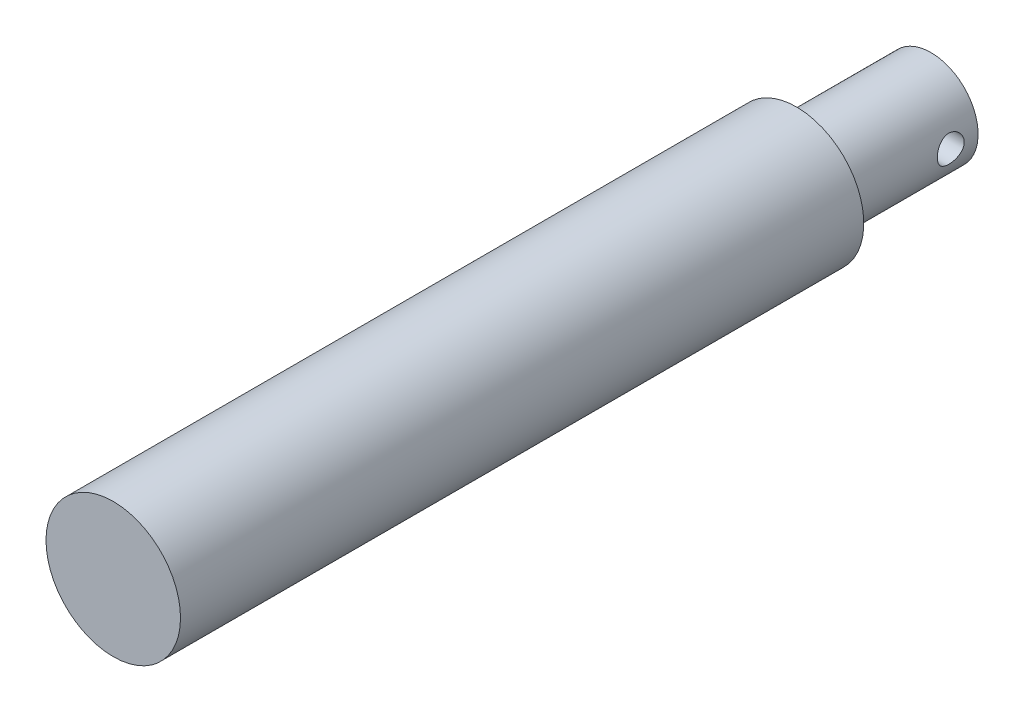
ISO-10303-21;
HEADER;
FILE_DESCRIPTION(('STEP AP214'),'2;1');
FILE_NAME('part.step','',(''),(''),'','','');
FILE_SCHEMA(('AUTOMOTIVE_DESIGN { 1 0 10303 214 1 1 1 1 }'));
ENDSEC;
DATA;
#1=APPLICATION_CONTEXT('core data for automotive mechanical design processes');
#2=APPLICATION_PROTOCOL_DEFINITION('international standard','automotive_design',2000,#1);
#3=PRODUCT_CONTEXT('',#1,'mechanical');
#4=PRODUCT('Part','Part','',(#3));
#5=PRODUCT_RELATED_PRODUCT_CATEGORY('part','',(#4));
#6=PRODUCT_DEFINITION_FORMATION('','',#4);
#7=PRODUCT_DEFINITION_CONTEXT('part definition',#1,'design');
#8=PRODUCT_DEFINITION('design','',#6,#7);
#9=PRODUCT_DEFINITION_SHAPE('','',#8);
#10=(LENGTH_UNIT() NAMED_UNIT(*) SI_UNIT(.MILLI.,.METRE.));
#11=(NAMED_UNIT(*) PLANE_ANGLE_UNIT() SI_UNIT($,.RADIAN.));
#12=(NAMED_UNIT(*) SI_UNIT($,.STERADIAN.) SOLID_ANGLE_UNIT());
#13=UNCERTAINTY_MEASURE_WITH_UNIT(LENGTH_MEASURE(1.E-05),#10,'distance_accuracy_value','');
#14=(GEOMETRIC_REPRESENTATION_CONTEXT(3) GLOBAL_UNCERTAINTY_ASSIGNED_CONTEXT((#13)) GLOBAL_UNIT_ASSIGNED_CONTEXT((#10,
#11,#12)) REPRESENTATION_CONTEXT('',''));
#15=CARTESIAN_POINT('',(0.,0.,0.));
#16=DIRECTION('',(0.,0.,1.));
#17=DIRECTION('',(1.,0.,0.));
#18=AXIS2_PLACEMENT_3D('',#15,#16,#17);
#19=CARTESIAN_POINT('',(0.,0.,60.8));
#20=DIRECTION('',(0.,0.,-1.));
#21=DIRECTION('',(-1.,0.,0.));
#22=AXIS2_PLACEMENT_3D('',#19,#20,#21);
#23=CYLINDRICAL_SURFACE('',#22,5.);
#24=CARTESIAN_POINT('',(0.,0.,60.8));
#25=DIRECTION('',(0.,0.,1.));
#26=DIRECTION('',(1.,0.,0.));
#27=AXIS2_PLACEMENT_3D('',#24,#25,#26);
#28=CIRCLE('',#27,5.);
#29=CARTESIAN_POINT('',(5.,0.,60.8));
#30=VERTEX_POINT('',#29);
#31=EDGE_CURVE('E11',#30,#30,#28,.T.);
#32=ORIENTED_EDGE('',*,*,#31,.F.);
#33=EDGE_LOOP('',(#32));
#34=FACE_BOUND('',#33,.T.);
#35=CARTESIAN_POINT('',(0.,0.,10.));
#36=DIRECTION('',(0.,0.,-1.));
#37=DIRECTION('',(-1.,0.,0.));
#38=AXIS2_PLACEMENT_3D('',#35,#36,#37);
#39=CIRCLE('',#38,5.);
#40=CARTESIAN_POINT('',(-5.,0.,10.));
#41=VERTEX_POINT('',#40);
#42=EDGE_CURVE('E35',#41,#41,#39,.T.);
#43=ORIENTED_EDGE('',*,*,#42,.F.);
#44=EDGE_LOOP('',(#43));
#45=FACE_BOUND('',#44,.T.);
#46=ADVANCED_FACE('F32',(#34,#45),#23,.T.);
#47=CARTESIAN_POINT('',(0.,0.,60.8));
#48=DIRECTION('',(0.,0.,1.));
#49=DIRECTION('',(1.,0.,0.));
#50=AXIS2_PLACEMENT_3D('',#47,#48,#49);
#51=PLANE('',#50);
#52=ORIENTED_EDGE('',*,*,#31,.T.);
#53=EDGE_LOOP('',(#52));
#54=FACE_BOUND('',#53,.T.);
#55=ADVANCED_FACE('F69',(#54),#51,.T.);
#56=CARTESIAN_POINT('',(0.,0.,10.));
#57=DIRECTION('',(0.,0.,-1.));
#58=DIRECTION('',(-1.,0.,0.));
#59=AXIS2_PLACEMENT_3D('',#56,#57,#58);
#60=PLANE('',#59);
#61=CARTESIAN_POINT('',(0.,0.,10.));
#62=DIRECTION('',(0.,0.,-1.));
#63=DIRECTION('',(-1.,0.,0.));
#64=AXIS2_PLACEMENT_3D('',#61,#62,#63);
#65=CIRCLE('',#64,3.5);
#66=CARTESIAN_POINT('',(-3.5,0.,10.));
#67=VERTEX_POINT('',#66);
#68=EDGE_CURVE('E54',#67,#67,#65,.T.);
#69=ORIENTED_EDGE('',*,*,#68,.F.);
#70=EDGE_LOOP('',(#69));
#71=FACE_BOUND('',#70,.T.);
#72=ORIENTED_EDGE('',*,*,#42,.T.);
#73=EDGE_LOOP('',(#72));
#74=FACE_BOUND('',#73,.T.);
#75=ADVANCED_FACE('F65',(#71,#74),#60,.T.);
#76=CARTESIAN_POINT('',(0.,0.,10.));
#77=DIRECTION('',(0.,0.,-1.));
#78=DIRECTION('',(-1.,0.,0.));
#79=AXIS2_PLACEMENT_3D('',#76,#77,#78);
#80=CYLINDRICAL_SURFACE('',#79,3.5);
#81=CARTESIAN_POINT('',(3.5,0.,1.03141713555161));
#82=CARTESIAN_POINT('',(3.49999934647171,-0.0549774511886257,1.03141810533258));
#83=CARTESIAN_POINT('',(3.49869208701023,-0.109964873936291,1.03596603003966));
#84=CARTESIAN_POINT('',(3.49360452972549,-0.218345995598494,1.05399927060276));
#85=CARTESIAN_POINT('',(3.48982329605034,-0.271739083414807,1.06748796858865));
#86=CARTESIAN_POINT('',(3.48020345674544,-0.375352150368936,1.10292115475986));
#87=CARTESIAN_POINT('',(3.474367720532,-0.425576440424113,1.12485385362759));
#88=CARTESIAN_POINT('',(3.46124989158242,-0.521634380564634,1.17650613129077));
#89=CARTESIAN_POINT('',(3.45396764753901,-0.567467570589077,1.20622652479675));
#90=CARTESIAN_POINT('',(3.43852367312902,-0.654647223429478,1.2734346408881));
#91=CARTESIAN_POINT('',(3.4303452097302,-0.69586186119049,1.31108951247939));
#92=CARTESIAN_POINT('',(3.41413367457396,-0.771485678962155,1.3927410071203));
#93=CARTESIAN_POINT('',(3.40610062478084,-0.805893838538838,1.43673857936717));
#94=CARTESIAN_POINT('',(3.39091507439313,-0.867598950032228,1.53091392694762));
#95=CARTESIAN_POINT('',(3.38378351259108,-0.894739105517028,1.58119812808614));
#96=CARTESIAN_POINT('',(3.37145671914235,-0.940125852769615,1.68585314142489));
#97=CARTESIAN_POINT('',(3.36626107099664,-0.958374357777524,1.7402230715792));
#98=CARTESIAN_POINT('',(3.35856804120241,-0.984992165068876,1.85003451713566));
#99=CARTESIAN_POINT('',(3.35600489366891,-0.993602766016075,1.90541281695072));
#100=CARTESIAN_POINT('',(3.35367104182518,-1.00145333894795,2.01688270979323));
#101=CARTESIAN_POINT('',(3.35389973075333,-1.00069534704803,2.07297414518475));
#102=CARTESIAN_POINT('',(3.35706517184156,-0.990020673813953,2.1823514412784));
#103=CARTESIAN_POINT('',(3.35991391343389,-0.980401628641805,2.23566931114164));
#104=CARTESIAN_POINT('',(3.36785674196985,-0.952756930429097,2.33990074536575));
#105=CARTESIAN_POINT('',(3.37295103189705,-0.934730517406289,2.39081409191195));
#106=CARTESIAN_POINT('',(3.38488431756517,-0.890553405689019,2.48954025776742));
#107=CARTESIAN_POINT('',(3.39174458202416,-0.864302755864395,2.53730567175242));
#108=CARTESIAN_POINT('',(3.40642608441438,-0.804491895839434,2.62785541615833));
#109=CARTESIAN_POINT('',(3.41424753611067,-0.770930058366727,2.67063863441907));
#110=CARTESIAN_POINT('',(3.43033125328062,-0.695951998365101,2.75170332335478));
#111=CARTESIAN_POINT('',(3.43859902286152,-0.654287437422663,2.78975437353522));
#112=CARTESIAN_POINT('',(3.45438123609203,-0.565066141193113,2.85838013737175));
#113=CARTESIAN_POINT('',(3.46189564068921,-0.517509100740946,2.88895446357246));
#114=CARTESIAN_POINT('',(3.47538264032742,-0.417461536545722,2.94188150293862));
#115=CARTESIAN_POINT('',(3.48134637748612,-0.364944908905002,2.9641872789537));
#116=CARTESIAN_POINT('',(3.49099625743795,-0.256696614983734,2.99958408126002));
#117=CARTESIAN_POINT('',(3.49468297428128,-0.200965762905073,3.01267743017424));
#118=CARTESIAN_POINT('',(3.49927437257336,-0.0898331943221743,3.02890377840633));
#119=CARTESIAN_POINT('',(3.50026636425301,-0.0344806734302531,3.03234948323812));
#120=CARTESIAN_POINT('',(3.49961042353544,0.0760132634027915,3.03005350240109));
#121=CARTESIAN_POINT('',(3.49796280790308,0.131154703878553,3.02431291912865));
#122=CARTESIAN_POINT('',(3.49226963342609,0.238509316715159,3.00406191339347));
#123=CARTESIAN_POINT('',(3.48827306508862,0.290759105867428,2.98973054488989));
#124=CARTESIAN_POINT('',(3.4783399937092,0.392104343102815,2.95291688455929));
#125=CARTESIAN_POINT('',(3.47240326632854,0.441199425624338,2.930433650107));
#126=CARTESIAN_POINT('',(3.45904980584657,0.536020842560038,2.87740546722898));
#127=CARTESIAN_POINT('',(3.45160381589487,0.581651243270127,2.84669653613871));
#128=CARTESIAN_POINT('',(3.43608973548903,0.667219264029655,2.77829088257629));
#129=CARTESIAN_POINT('',(3.42802150376367,0.707155585421215,2.74059257052017));
#130=CARTESIAN_POINT('',(3.41184309815947,0.781553214170354,2.65781246452601));
#131=CARTESIAN_POINT('',(3.40374018433795,0.81579271370477,2.61252949776876));
#132=CARTESIAN_POINT('',(3.38869447362751,0.876197658032581,2.5166858412426));
#133=CARTESIAN_POINT('',(3.3817516363796,0.902363383738855,2.4661253351784));
#134=CARTESIAN_POINT('',(3.36989325638715,0.945687270594172,2.36137153005573));
#135=CARTESIAN_POINT('',(3.36496700079018,0.962893166212217,2.30719925376526));
#136=CARTESIAN_POINT('',(3.35771228398834,0.987897250353705,2.19656216772441));
#137=CARTESIAN_POINT('',(3.35538303564047,0.995698289511611,2.1400980580006));
#138=CARTESIAN_POINT('',(3.35365851547575,1.00149012123096,2.02876911909083));
#139=CARTESIAN_POINT('',(3.35415580399703,0.999840138221142,1.97392438327531));
#140=CARTESIAN_POINT('',(3.35777298607399,0.987623554788215,1.86532977021872));
#141=CARTESIAN_POINT('',(3.36089279211716,0.977057251899602,1.8115798565051));
#142=CARTESIAN_POINT('',(3.36933488579116,0.947529844083142,1.70722794996784));
#143=CARTESIAN_POINT('',(3.37463438524179,0.928655458931764,1.65659944204616));
#144=CARTESIAN_POINT('',(3.38683651421364,0.883114746507969,1.55918776830536));
#145=CARTESIAN_POINT('',(3.3937394274128,0.856447040215778,1.51240528491495));
#146=CARTESIAN_POINT('',(3.40865834474881,0.795032732674125,1.42232537464898));
#147=CARTESIAN_POINT('',(3.41670381589509,0.760046138613655,1.37919643988064));
#148=CARTESIAN_POINT('',(3.43284922546139,0.683429920189678,1.29930518764669));
#149=CARTESIAN_POINT('',(3.4409491770859,0.64179862536428,1.2625444759962));
#150=CARTESIAN_POINT('',(3.45653979786176,0.551787160432695,1.1954985433883));
#151=CARTESIAN_POINT('',(3.46400950518705,0.50326125117989,1.16540364191679));
#152=CARTESIAN_POINT('',(3.47725697888987,0.401625264823331,1.1138442430406));
#153=CARTESIAN_POINT('',(3.48303566935144,0.34851771205737,1.09237502958507));
#154=CARTESIAN_POINT('',(3.49163672362653,0.246458157667517,1.06099335985388));
#155=CARTESIAN_POINT('',(3.49474842181038,0.197881503812195,1.04993036720933));
#156=CARTESIAN_POINT('',(3.49893021926074,0.0995391843931838,1.03514230693053));
#157=CARTESIAN_POINT('',(3.50000059166997,0.049773678808046,1.03141625756316));
#158=CARTESIAN_POINT('',(3.5,0.,1.03141713555161));
#159=B_SPLINE_CURVE_WITH_KNOTS('',3,(#81,#82,#83,#84,#85,#86,#87,#88,#89,#90,#91,#92,#93,#94,
#95,#96,#97,#98,#99,#100,#101,#102,#103,#104,#105,#106,#107,#108,#109,#110,#111,#112,#113,#114,
#115,#116,#117,#118,#119,#120,#121,#122,#123,#124,#125,#126,#127,#128,#129,#130,#131,#132,#133,
#134,#135,#136,#137,#138,#139,#140,#141,#142,#143,#144,#145,#146,#147,#148,#149,#150,#151,#152,
#153,#154,#155,#156,#157,#158),.UNSPECIFIED.,.T.,.F.,(4,2,2,2,2,2,2,2,2,2,2,2,2,2,2,2,2,2,2,2,2,
2,2,2,2,2,2,2,2,2,2,2,2,2,2,2,2,2,4),(0.,0.164749656271172,0.32956166989759,0.494144406447671,
0.658744367717579,0.827239057653907,0.995758989368567,1.16766537650029,1.33953475772405,
1.50699754929408,1.67442394611628,1.83642392910678,1.99843855889074,2.16250401641616,
2.32660602784683,2.49689250297262,2.66718780073736,2.83843550548235,3.00964002003317,
3.17522728845111,3.34079468713335,3.50302570235771,3.66527548283776,3.83103762668237,
3.99683751589905,4.16806052438178,4.3392775747866,4.50957286677749,4.6798165288708,
4.84363340801449,5.00744482086202,5.16958548138845,5.33175484992001,5.49933828438395,
5.66696391547449,5.83888989478295,6.01072174610257,6.15989734012186,6.30905297207072),.UNSPECIFIED.);
#160=CARTESIAN_POINT('',(3.5,0.,1.03141713555161));
#161=VERTEX_POINT('',#160);
#162=EDGE_CURVE('E48',#161,#161,#159,.T.);
#163=ORIENTED_EDGE('',*,*,#162,.T.);
#164=EDGE_LOOP('',(#163));
#165=FACE_BOUND('',#164,.T.);
#166=ORIENTED_EDGE('',*,*,#68,.T.);
#167=EDGE_LOOP('',(#166));
#168=FACE_BOUND('',#167,.T.);
#169=CARTESIAN_POINT('',(0.,0.,0.));
#170=DIRECTION('',(0.,0.,-1.));
#171=DIRECTION('',(-1.,0.,0.));
#172=AXIS2_PLACEMENT_3D('',#169,#170,#171);
#173=CIRCLE('',#172,3.5);
#174=CARTESIAN_POINT('',(-3.5,0.,0.));
#175=VERTEX_POINT('',#174);
#176=EDGE_CURVE('E46',#175,#175,#173,.T.);
#177=ORIENTED_EDGE('',*,*,#176,.F.);
#178=EDGE_LOOP('',(#177));
#179=FACE_BOUND('',#178,.T.);
#180=CARTESIAN_POINT('',(-3.5,0.,1.03141713555161));
#181=CARTESIAN_POINT('',(-3.49999934647171,0.0549774511886257,1.03141810533258));
#182=CARTESIAN_POINT('',(-3.49869208701023,0.109964873936291,1.03596603003966));
#183=CARTESIAN_POINT('',(-3.49360452972549,0.218345995598494,1.05399927060276));
#184=CARTESIAN_POINT('',(-3.48982329605034,0.271739083414807,1.06748796858865));
#185=CARTESIAN_POINT('',(-3.48020345674544,0.375352150368936,1.10292115475986));
#186=CARTESIAN_POINT('',(-3.474367720532,0.425576440424113,1.12485385362759));
#187=CARTESIAN_POINT('',(-3.46124989158242,0.521634380564634,1.17650613129077));
#188=CARTESIAN_POINT('',(-3.45396764753901,0.567467570589077,1.20622652479675));
#189=CARTESIAN_POINT('',(-3.43852367312902,0.654647223429478,1.2734346408881));
#190=CARTESIAN_POINT('',(-3.4303452097302,0.69586186119049,1.31108951247939));
#191=CARTESIAN_POINT('',(-3.41413367457396,0.771485678962155,1.3927410071203));
#192=CARTESIAN_POINT('',(-3.40610062478084,0.805893838538838,1.43673857936717));
#193=CARTESIAN_POINT('',(-3.39091507439313,0.867598950032228,1.53091392694762));
#194=CARTESIAN_POINT('',(-3.38378351259108,0.894739105517028,1.58119812808614));
#195=CARTESIAN_POINT('',(-3.37145671914235,0.940125852769615,1.68585314142489));
#196=CARTESIAN_POINT('',(-3.36626107099664,0.958374357777524,1.7402230715792));
#197=CARTESIAN_POINT('',(-3.35856804120241,0.984992165068876,1.85003451713566));
#198=CARTESIAN_POINT('',(-3.35600489366891,0.993602766016075,1.90541281695072));
#199=CARTESIAN_POINT('',(-3.35367104182518,1.00145333894795,2.01688270979323));
#200=CARTESIAN_POINT('',(-3.35389973075333,1.00069534704803,2.07297414518475));
#201=CARTESIAN_POINT('',(-3.35706517184156,0.990020673813953,2.1823514412784));
#202=CARTESIAN_POINT('',(-3.35991391343389,0.980401628641805,2.23566931114164));
#203=CARTESIAN_POINT('',(-3.36785674196985,0.952756930429097,2.33990074536575));
#204=CARTESIAN_POINT('',(-3.37295103189705,0.934730517406289,2.39081409191195));
#205=CARTESIAN_POINT('',(-3.38488431756517,0.890553405689019,2.48954025776742));
#206=CARTESIAN_POINT('',(-3.39174458202416,0.864302755864395,2.53730567175242));
#207=CARTESIAN_POINT('',(-3.40642608441438,0.804491895839434,2.62785541615833));
#208=CARTESIAN_POINT('',(-3.41424753611067,0.770930058366727,2.67063863441907));
#209=CARTESIAN_POINT('',(-3.43033125328062,0.695951998365101,2.75170332335478));
#210=CARTESIAN_POINT('',(-3.43859902286152,0.654287437422663,2.78975437353522));
#211=CARTESIAN_POINT('',(-3.45438123609203,0.565066141193113,2.85838013737175));
#212=CARTESIAN_POINT('',(-3.46189564068921,0.517509100740946,2.88895446357246));
#213=CARTESIAN_POINT('',(-3.47538264032742,0.417461536545722,2.94188150293862));
#214=CARTESIAN_POINT('',(-3.48134637748612,0.364944908905002,2.9641872789537));
#215=CARTESIAN_POINT('',(-3.49099625743795,0.256696614983734,2.99958408126002));
#216=CARTESIAN_POINT('',(-3.49468297428128,0.200965762905073,3.01267743017424));
#217=CARTESIAN_POINT('',(-3.49927437257336,0.0898331943221743,3.02890377840633));
#218=CARTESIAN_POINT('',(-3.50026636425301,0.0344806734302531,3.03234948323812));
#219=CARTESIAN_POINT('',(-3.49961042353544,-0.0760132634027915,3.03005350240109));
#220=CARTESIAN_POINT('',(-3.49796280790308,-0.131154703878553,3.02431291912865));
#221=CARTESIAN_POINT('',(-3.49226963342609,-0.238509316715159,3.00406191339347));
#222=CARTESIAN_POINT('',(-3.48827306508862,-0.290759105867428,2.98973054488989));
#223=CARTESIAN_POINT('',(-3.4783399937092,-0.392104343102815,2.95291688455929));
#224=CARTESIAN_POINT('',(-3.47240326632854,-0.441199425624338,2.930433650107));
#225=CARTESIAN_POINT('',(-3.45904980584657,-0.536020842560038,2.87740546722898));
#226=CARTESIAN_POINT('',(-3.45160381589487,-0.581651243270127,2.84669653613871));
#227=CARTESIAN_POINT('',(-3.43608973548903,-0.667219264029655,2.77829088257629));
#228=CARTESIAN_POINT('',(-3.42802150376367,-0.707155585421215,2.74059257052017));
#229=CARTESIAN_POINT('',(-3.41184309815947,-0.781553214170354,2.65781246452601));
#230=CARTESIAN_POINT('',(-3.40374018433795,-0.81579271370477,2.61252949776876));
#231=CARTESIAN_POINT('',(-3.38869447362751,-0.876197658032581,2.5166858412426));
#232=CARTESIAN_POINT('',(-3.3817516363796,-0.902363383738855,2.4661253351784));
#233=CARTESIAN_POINT('',(-3.36989325638715,-0.945687270594172,2.36137153005573));
#234=CARTESIAN_POINT('',(-3.36496700079018,-0.962893166212217,2.30719925376526));
#235=CARTESIAN_POINT('',(-3.35771228398834,-0.987897250353705,2.19656216772441));
#236=CARTESIAN_POINT('',(-3.35538303564047,-0.995698289511611,2.1400980580006));
#237=CARTESIAN_POINT('',(-3.35365851547575,-1.00149012123096,2.02876911909083));
#238=CARTESIAN_POINT('',(-3.35415580399703,-0.999840138221142,1.97392438327531));
#239=CARTESIAN_POINT('',(-3.35777298607399,-0.987623554788215,1.86532977021872));
#240=CARTESIAN_POINT('',(-3.36089279211716,-0.977057251899602,1.8115798565051));
#241=CARTESIAN_POINT('',(-3.36933488579116,-0.947529844083142,1.70722794996784));
#242=CARTESIAN_POINT('',(-3.37463438524179,-0.928655458931764,1.65659944204616));
#243=CARTESIAN_POINT('',(-3.38683651421364,-0.883114746507969,1.55918776830536));
#244=CARTESIAN_POINT('',(-3.3937394274128,-0.856447040215778,1.51240528491495));
#245=CARTESIAN_POINT('',(-3.40865834474881,-0.795032732674125,1.42232537464898));
#246=CARTESIAN_POINT('',(-3.41670381589509,-0.760046138613655,1.37919643988064));
#247=CARTESIAN_POINT('',(-3.43284922546139,-0.683429920189678,1.29930518764669));
#248=CARTESIAN_POINT('',(-3.4409491770859,-0.64179862536428,1.2625444759962));
#249=CARTESIAN_POINT('',(-3.45653979786176,-0.551787160432695,1.1954985433883));
#250=CARTESIAN_POINT('',(-3.46400950518705,-0.50326125117989,1.16540364191679));
#251=CARTESIAN_POINT('',(-3.47725697888987,-0.401625264823331,1.1138442430406));
#252=CARTESIAN_POINT('',(-3.48303566935144,-0.34851771205737,1.09237502958507));
#253=CARTESIAN_POINT('',(-3.49163672362653,-0.246458157667517,1.06099335985388));
#254=CARTESIAN_POINT('',(-3.49474842181038,-0.197881503812195,1.04993036720933));
#255=CARTESIAN_POINT('',(-3.49893021926074,-0.0995391843931838,1.03514230693053));
#256=CARTESIAN_POINT('',(-3.50000059166997,-0.049773678808046,1.03141625756316));
#257=CARTESIAN_POINT('',(-3.5,0.,1.03141713555161));
#258=B_SPLINE_CURVE_WITH_KNOTS('',3,(#180,#181,#182,#183,#184,#185,#186,#187,#188,#189,#190,
#191,#192,#193,#194,#195,#196,#197,#198,#199,#200,#201,#202,#203,#204,#205,#206,#207,#208,#209,
#210,#211,#212,#213,#214,#215,#216,#217,#218,#219,#220,#221,#222,#223,#224,#225,#226,#227,#228,
#229,#230,#231,#232,#233,#234,#235,#236,#237,#238,#239,#240,#241,#242,#243,#244,#245,#246,#247,
#248,#249,#250,#251,#252,#253,#254,#255,#256,#257),.UNSPECIFIED.,.T.,.F.,(4,2,2,2,2,2,2,2,2,2,2,
2,2,2,2,2,2,2,2,2,2,2,2,2,2,2,2,2,2,2,2,2,2,2,2,2,2,2,4),(0.,0.164749656271172,0.32956166989759,
0.494144406447671,0.658744367717579,0.827239057653907,0.995758989368567,1.16766537650029,
1.33953475772405,1.50699754929408,1.67442394611628,1.83642392910678,1.99843855889074,
2.16250401641616,2.32660602784683,2.49689250297262,2.66718780073736,2.83843550548235,
3.00964002003317,3.17522728845111,3.34079468713335,3.50302570235771,3.66527548283776,
3.83103762668237,3.99683751589905,4.16806052438178,4.3392775747866,4.50957286677749,
4.6798165288708,4.84363340801449,5.00744482086202,5.16958548138845,5.33175484992001,
5.49933828438395,5.66696391547449,5.83888989478295,6.01072174610257,6.15989734012186,
6.30905297207072),.UNSPECIFIED.);
#259=CARTESIAN_POINT('',(-3.5,0.,1.03141713555161));
#260=VERTEX_POINT('',#259);
#261=EDGE_CURVE('E43',#260,#260,#258,.T.);
#262=ORIENTED_EDGE('',*,*,#261,.T.);
#263=EDGE_LOOP('',(#262));
#264=FACE_BOUND('',#263,.T.);
#265=ADVANCED_FACE('F61',(#165,#168,#179,#264),#80,.T.);
#266=CARTESIAN_POINT('',(0.,0.,0.));
#267=DIRECTION('',(0.,0.,1.));
#268=DIRECTION('',(1.,0.,0.));
#269=AXIS2_PLACEMENT_3D('',#266,#267,#268);
#270=PLANE('',#269);
#271=ORIENTED_EDGE('',*,*,#176,.T.);
#272=EDGE_LOOP('',(#271));
#273=FACE_BOUND('',#272,.T.);
#274=ADVANCED_FACE('F64',(#273),#270,.F.);
#275=CARTESIAN_POINT('',(-5.,0.,2.03141713555161));
#276=DIRECTION('',(1.,0.,0.));
#277=DIRECTION('',(0.,0.,-1.));
#278=AXIS2_PLACEMENT_3D('',#275,#276,#277);
#279=CYLINDRICAL_SURFACE('',#278,1.);
#280=ORIENTED_EDGE('',*,*,#162,.F.);
#281=EDGE_LOOP('',(#280));
#282=FACE_BOUND('',#281,.T.);
#283=ORIENTED_EDGE('',*,*,#261,.F.);
#284=EDGE_LOOP('',(#283));
#285=FACE_BOUND('',#284,.T.);
#286=ADVANCED_FACE('F57',(#282,#285),#279,.F.);
#287=CLOSED_SHELL('',(#46,#55,#75,#265,#274,#286));
#288=MANIFOLD_SOLID_BREP('B2',#287);
#289=ADVANCED_BREP_SHAPE_REPRESENTATION('',(#18,#288),#14);
#290=SHAPE_DEFINITION_REPRESENTATION(#9,#289);
ENDSEC;
END-ISO-10303-21;
